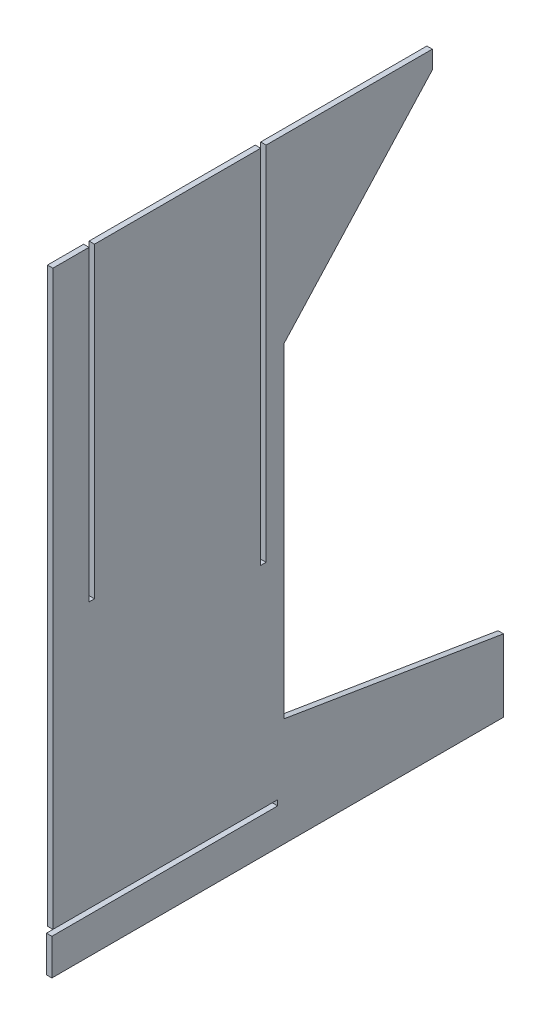
ISO-10303-21;
HEADER;
FILE_DESCRIPTION(('STEP AP214'),'2;1');
FILE_NAME('part.step','',(''),(''),'','','');
FILE_SCHEMA(('AUTOMOTIVE_DESIGN { 1 0 10303 214 1 1 1 1 }'));
ENDSEC;
DATA;
#1=APPLICATION_CONTEXT('core data for automotive mechanical design processes');
#2=APPLICATION_PROTOCOL_DEFINITION('international standard','automotive_design',2000,#1);
#3=PRODUCT_CONTEXT('',#1,'mechanical');
#4=PRODUCT('Part','Part','',(#3));
#5=PRODUCT_RELATED_PRODUCT_CATEGORY('part','',(#4));
#6=PRODUCT_DEFINITION_FORMATION('','',#4);
#7=PRODUCT_DEFINITION_CONTEXT('part definition',#1,'design');
#8=PRODUCT_DEFINITION('design','',#6,#7);
#9=PRODUCT_DEFINITION_SHAPE('','',#8);
#10=(LENGTH_UNIT() NAMED_UNIT(*) SI_UNIT(.MILLI.,.METRE.));
#11=(NAMED_UNIT(*) PLANE_ANGLE_UNIT() SI_UNIT($,.RADIAN.));
#12=(NAMED_UNIT(*) SI_UNIT($,.STERADIAN.) SOLID_ANGLE_UNIT());
#13=UNCERTAINTY_MEASURE_WITH_UNIT(LENGTH_MEASURE(1.E-05),#10,'distance_accuracy_value','');
#14=(GEOMETRIC_REPRESENTATION_CONTEXT(3) GLOBAL_UNCERTAINTY_ASSIGNED_CONTEXT((#13)) GLOBAL_UNIT_ASSIGNED_CONTEXT((#10,
#11,#12)) REPRESENTATION_CONTEXT('',''));
#15=CARTESIAN_POINT('',(0.,0.,0.));
#16=DIRECTION('',(0.,0.,1.));
#17=DIRECTION('',(1.,0.,0.));
#18=AXIS2_PLACEMENT_3D('',#15,#16,#17);
#19=CARTESIAN_POINT('',(3.,50.0959820841257,104.430296427276));
#20=DIRECTION('',(0.,-1.,0.));
#21=DIRECTION('',(0.,0.,-1.));
#22=AXIS2_PLACEMENT_3D('',#19,#20,#21);
#23=PLANE('',#22);
#24=DIRECTION('',(0.,0.,1.));
#25=VECTOR('',#24,1.);
#26=CARTESIAN_POINT('',(0.,50.0959820841257,104.430296427276));
#27=LINE('',#26,#25);
#28=CARTESIAN_POINT('',(0.,50.0959820841257,104.430296427276));
#29=VERTEX_POINT('',#28);
#30=CARTESIAN_POINT('',(0.,50.0959820841257,124.430296427276));
#31=VERTEX_POINT('',#30);
#32=EDGE_CURVE('E212',#29,#31,#27,.T.);
#33=ORIENTED_EDGE('',*,*,#32,.T.);
#34=DIRECTION('',(-1.,0.,0.));
#35=VECTOR('',#34,1.);
#36=CARTESIAN_POINT('',(3.,50.0959820841257,124.430296427276));
#37=LINE('',#36,#35);
#38=CARTESIAN_POINT('',(3.,50.0959820841257,124.430296427276));
#39=VERTEX_POINT('',#38);
#40=EDGE_CURVE('E11',#39,#31,#37,.T.);
#41=ORIENTED_EDGE('',*,*,#40,.F.);
#42=DIRECTION('',(0.,0.,1.));
#43=VECTOR('',#42,1.);
#44=CARTESIAN_POINT('',(3.,50.0959820841257,104.430296427276));
#45=LINE('',#44,#43);
#46=CARTESIAN_POINT('',(3.,50.0959820841257,104.430296427276));
#47=VERTEX_POINT('',#46);
#48=EDGE_CURVE('E270',#47,#39,#45,.T.);
#49=ORIENTED_EDGE('',*,*,#48,.F.);
#50=DIRECTION('',(-1.,0.,0.));
#51=VECTOR('',#50,1.);
#52=CARTESIAN_POINT('',(3.,50.0959820841257,104.430296427276));
#53=LINE('',#52,#51);
#54=EDGE_CURVE('E208',#47,#29,#53,.T.);
#55=ORIENTED_EDGE('',*,*,#54,.T.);
#56=EDGE_LOOP('',(#33,#41,#49,#55));
#57=FACE_BOUND('',#56,.T.);
#58=ADVANCED_FACE('F39',(#57),#23,.F.);
#59=CARTESIAN_POINT('',(3.,-266.903540618244,124.430296427276));
#60=DIRECTION('',(0.,0.,-1.));
#61=DIRECTION('',(-1.,0.,0.));
#62=AXIS2_PLACEMENT_3D('',#59,#60,#61);
#63=PLANE('',#62);
#64=DIRECTION('',(0.,-1.,0.));
#65=VECTOR('',#64,1.);
#66=CARTESIAN_POINT('',(0.,-266.903540618244,124.430296427276));
#67=LINE('',#66,#65);
#68=CARTESIAN_POINT('',(0.,-266.903540618244,124.430296427276));
#69=VERTEX_POINT('',#68);
#70=EDGE_CURVE('E216',#31,#69,#67,.T.);
#71=ORIENTED_EDGE('',*,*,#70,.T.);
#72=DIRECTION('',(-1.,0.,0.));
#73=VECTOR('',#72,1.);
#74=CARTESIAN_POINT('',(3.,-266.903540618244,124.430296427276));
#75=LINE('',#74,#73);
#76=CARTESIAN_POINT('',(3.,-266.903540618244,124.430296427276));
#77=VERTEX_POINT('',#76);
#78=EDGE_CURVE('E48',#77,#69,#75,.T.);
#79=ORIENTED_EDGE('',*,*,#78,.F.);
#80=DIRECTION('',(0.,-1.,0.));
#81=VECTOR('',#80,1.);
#82=CARTESIAN_POINT('',(3.,-266.903540618244,124.430296427276));
#83=LINE('',#82,#81);
#84=EDGE_CURVE('E135',#39,#77,#83,.T.);
#85=ORIENTED_EDGE('',*,*,#84,.F.);
#86=ORIENTED_EDGE('',*,*,#40,.T.);
#87=EDGE_LOOP('',(#71,#79,#85,#86));
#88=FACE_BOUND('',#87,.T.);
#89=ADVANCED_FACE('F420',(#88),#63,.F.);
#90=CARTESIAN_POINT('',(3.,-266.903540618244,0.));
#91=DIRECTION('',(0.,1.,0.));
#92=DIRECTION('',(0.,0.,1.));
#93=AXIS2_PLACEMENT_3D('',#90,#91,#92);
#94=PLANE('',#93);
#95=DIRECTION('',(0.,0.,-1.));
#96=VECTOR('',#95,1.);
#97=CARTESIAN_POINT('',(0.,-266.903540618244,0.));
#98=LINE('',#97,#96);
#99=CARTESIAN_POINT('',(0.,-266.903540618244,0.));
#100=VERTEX_POINT('',#99);
#101=EDGE_CURVE('E219',#69,#100,#98,.T.);
#102=ORIENTED_EDGE('',*,*,#101,.T.);
#103=DIRECTION('',(-1.,0.,0.));
#104=VECTOR('',#103,1.);
#105=CARTESIAN_POINT('',(3.,-266.903540618244,0.));
#106=LINE('',#105,#104);
#107=CARTESIAN_POINT('',(3.,-266.903540618244,0.));
#108=VERTEX_POINT('',#107);
#109=EDGE_CURVE('E329',#108,#100,#106,.T.);
#110=ORIENTED_EDGE('',*,*,#109,.F.);
#111=DIRECTION('',(0.,0.,-1.));
#112=VECTOR('',#111,1.);
#113=CARTESIAN_POINT('',(3.,-266.903540618244,0.));
#114=LINE('',#113,#112);
#115=EDGE_CURVE('E339',#77,#108,#114,.T.);
#116=ORIENTED_EDGE('',*,*,#115,.F.);
#117=ORIENTED_EDGE('',*,*,#78,.T.);
#118=EDGE_LOOP('',(#102,#110,#116,#117));
#119=FACE_BOUND('',#118,.T.);
#120=ADVANCED_FACE('F337',(#119),#94,.F.);
#121=CARTESIAN_POINT('',(3.,-269.903540618244,0.));
#122=DIRECTION('',(0.,0.,-1.));
#123=DIRECTION('',(-1.,0.,0.));
#124=AXIS2_PLACEMENT_3D('',#121,#122,#123);
#125=PLANE('',#124);
#126=DIRECTION('',(0.,-1.,0.));
#127=VECTOR('',#126,1.);
#128=CARTESIAN_POINT('',(0.,-269.903540618244,0.));
#129=LINE('',#128,#127);
#130=CARTESIAN_POINT('',(0.,-269.903540618244,0.));
#131=VERTEX_POINT('',#130);
#132=EDGE_CURVE('E222',#100,#131,#129,.T.);
#133=ORIENTED_EDGE('',*,*,#132,.T.);
#134=DIRECTION('',(-1.,0.,0.));
#135=VECTOR('',#134,1.);
#136=CARTESIAN_POINT('',(3.,-269.903540618244,0.));
#137=LINE('',#136,#135);
#138=CARTESIAN_POINT('',(3.,-269.903540618244,0.));
#139=VERTEX_POINT('',#138);
#140=EDGE_CURVE('E325',#139,#131,#137,.T.);
#141=ORIENTED_EDGE('',*,*,#140,.F.);
#142=DIRECTION('',(0.,-1.,0.));
#143=VECTOR('',#142,1.);
#144=CARTESIAN_POINT('',(3.,-269.903540618244,0.));
#145=LINE('',#144,#143);
#146=EDGE_CURVE('E358',#108,#139,#145,.T.);
#147=ORIENTED_EDGE('',*,*,#146,.F.);
#148=ORIENTED_EDGE('',*,*,#109,.T.);
#149=EDGE_LOOP('',(#133,#141,#147,#148));
#150=FACE_BOUND('',#149,.T.);
#151=ADVANCED_FACE('F348',(#150),#125,.F.);
#152=CARTESIAN_POINT('',(3.,-269.903540618244,125.));
#153=DIRECTION('',(0.,-1.,0.));
#154=DIRECTION('',(0.,0.,-1.));
#155=AXIS2_PLACEMENT_3D('',#152,#153,#154);
#156=PLANE('',#155);
#157=DIRECTION('',(0.,0.,1.));
#158=VECTOR('',#157,1.);
#159=CARTESIAN_POINT('',(0.,-269.903540618244,125.));
#160=LINE('',#159,#158);
#161=CARTESIAN_POINT('',(0.,-269.903540618244,125.));
#162=VERTEX_POINT('',#161);
#163=EDGE_CURVE('E225',#131,#162,#160,.T.);
#164=ORIENTED_EDGE('',*,*,#163,.T.);
#165=DIRECTION('',(-1.,0.,0.));
#166=VECTOR('',#165,1.);
#167=CARTESIAN_POINT('',(3.,-269.903540618244,125.));
#168=LINE('',#167,#166);
#169=CARTESIAN_POINT('',(3.,-269.903540618244,125.));
#170=VERTEX_POINT('',#169);
#171=EDGE_CURVE('E321',#170,#162,#168,.T.);
#172=ORIENTED_EDGE('',*,*,#171,.F.);
#173=DIRECTION('',(0.,0.,1.));
#174=VECTOR('',#173,1.);
#175=CARTESIAN_POINT('',(3.,-269.903540618244,125.));
#176=LINE('',#175,#174);
#177=EDGE_CURVE('E354',#139,#170,#176,.T.);
#178=ORIENTED_EDGE('',*,*,#177,.F.);
#179=ORIENTED_EDGE('',*,*,#140,.T.);
#180=EDGE_LOOP('',(#164,#172,#178,#179));
#181=FACE_BOUND('',#180,.T.);
#182=ADVANCED_FACE('F352',(#181),#156,.F.);
#183=CARTESIAN_POINT('',(3.,-289.903540618244,125.));
#184=DIRECTION('',(0.,0.,-1.));
#185=DIRECTION('',(-1.,0.,0.));
#186=AXIS2_PLACEMENT_3D('',#183,#184,#185);
#187=PLANE('',#186);
#188=DIRECTION('',(0.,-1.,0.));
#189=VECTOR('',#188,1.);
#190=CARTESIAN_POINT('',(0.,-289.903540618244,125.));
#191=LINE('',#190,#189);
#192=CARTESIAN_POINT('',(0.,-289.903540618244,125.));
#193=VERTEX_POINT('',#192);
#194=EDGE_CURVE('E228',#162,#193,#191,.T.);
#195=ORIENTED_EDGE('',*,*,#194,.T.);
#196=DIRECTION('',(-1.,0.,0.));
#197=VECTOR('',#196,1.);
#198=CARTESIAN_POINT('',(3.,-289.903540618244,125.));
#199=LINE('',#198,#197);
#200=CARTESIAN_POINT('',(3.,-289.903540618244,125.));
#201=VERTEX_POINT('',#200);
#202=EDGE_CURVE('E317',#201,#193,#199,.T.);
#203=ORIENTED_EDGE('',*,*,#202,.F.);
#204=DIRECTION('',(0.,-1.,0.));
#205=VECTOR('',#204,1.);
#206=CARTESIAN_POINT('',(3.,-289.903540618244,125.));
#207=LINE('',#206,#205);
#208=EDGE_CURVE('E357',#170,#201,#207,.T.);
#209=ORIENTED_EDGE('',*,*,#208,.F.);
#210=ORIENTED_EDGE('',*,*,#171,.T.);
#211=EDGE_LOOP('',(#195,#203,#209,#210));
#212=FACE_BOUND('',#211,.T.);
#213=ADVANCED_FACE('F433',(#212),#187,.F.);
#214=CARTESIAN_POINT('',(3.,-289.903540618244,-125.));
#215=DIRECTION('',(0.,1.,0.));
#216=DIRECTION('',(0.,0.,1.));
#217=AXIS2_PLACEMENT_3D('',#214,#215,#216);
#218=PLANE('',#217);
#219=DIRECTION('',(0.,0.,-1.));
#220=VECTOR('',#219,1.);
#221=CARTESIAN_POINT('',(0.,-289.903540618244,-125.));
#222=LINE('',#221,#220);
#223=CARTESIAN_POINT('',(0.,-289.903540618244,-125.));
#224=VERTEX_POINT('',#223);
#225=EDGE_CURVE('E231',#193,#224,#222,.T.);
#226=ORIENTED_EDGE('',*,*,#225,.T.);
#227=DIRECTION('',(-1.,0.,0.));
#228=VECTOR('',#227,1.);
#229=CARTESIAN_POINT('',(3.,-289.903540618244,-125.));
#230=LINE('',#229,#228);
#231=CARTESIAN_POINT('',(3.,-289.903540618244,-125.));
#232=VERTEX_POINT('',#231);
#233=EDGE_CURVE('E313',#232,#224,#230,.T.);
#234=ORIENTED_EDGE('',*,*,#233,.F.);
#235=DIRECTION('',(0.,0.,-1.));
#236=VECTOR('',#235,1.);
#237=CARTESIAN_POINT('',(3.,-289.903540618244,-125.));
#238=LINE('',#237,#236);
#239=EDGE_CURVE('E362',#201,#232,#238,.T.);
#240=ORIENTED_EDGE('',*,*,#239,.F.);
#241=ORIENTED_EDGE('',*,*,#202,.T.);
#242=EDGE_LOOP('',(#226,#234,#240,#241));
#243=FACE_BOUND('',#242,.T.);
#244=ADVANCED_FACE('F436',(#243),#218,.F.);
#245=CARTESIAN_POINT('',(3.,-249.903540618244,-125.));
#246=DIRECTION('',(0.,0.,1.));
#247=DIRECTION('',(1.,0.,0.));
#248=AXIS2_PLACEMENT_3D('',#245,#246,#247);
#249=PLANE('',#248);
#250=DIRECTION('',(0.,1.,0.));
#251=VECTOR('',#250,1.);
#252=CARTESIAN_POINT('',(0.,-249.903540618244,-125.));
#253=LINE('',#252,#251);
#254=CARTESIAN_POINT('',(0.,-249.903540618244,-125.));
#255=VERTEX_POINT('',#254);
#256=EDGE_CURVE('E234',#224,#255,#253,.T.);
#257=ORIENTED_EDGE('',*,*,#256,.T.);
#258=DIRECTION('',(-1.,0.,0.));
#259=VECTOR('',#258,1.);
#260=CARTESIAN_POINT('',(3.,-249.903540618244,-125.));
#261=LINE('',#260,#259);
#262=CARTESIAN_POINT('',(3.,-249.903540618244,-125.));
#263=VERTEX_POINT('',#262);
#264=EDGE_CURVE('E309',#263,#255,#261,.T.);
#265=ORIENTED_EDGE('',*,*,#264,.F.);
#266=DIRECTION('',(0.,1.,0.));
#267=VECTOR('',#266,1.);
#268=CARTESIAN_POINT('',(3.,-249.903540618244,-125.));
#269=LINE('',#268,#267);
#270=EDGE_CURVE('E369',#232,#263,#269,.T.);
#271=ORIENTED_EDGE('',*,*,#270,.F.);
#272=ORIENTED_EDGE('',*,*,#233,.T.);
#273=EDGE_LOOP('',(#257,#265,#271,#272));
#274=FACE_BOUND('',#273,.T.);
#275=ADVANCED_FACE('F440',(#274),#249,.F.);
#276=CARTESIAN_POINT('',(3.,-229.903540618244,-3.56970357272368));
#277=DIRECTION('',(0.,-0.986706235781448,0.162514012534323));
#278=DIRECTION('',(0.,-0.162514012534323,-0.986706235781448));
#279=AXIS2_PLACEMENT_3D('',#276,#277,#278);
#280=PLANE('',#279);
#281=DIRECTION('',(0.,0.162514012534323,0.986706235781448));
#282=VECTOR('',#281,1.);
#283=CARTESIAN_POINT('',(0.,-229.903540618244,-3.56970357272368));
#284=LINE('',#283,#282);
#285=CARTESIAN_POINT('',(0.,-229.903540618244,-3.56970357272368));
#286=VERTEX_POINT('',#285);
#287=EDGE_CURVE('E237',#255,#286,#284,.T.);
#288=ORIENTED_EDGE('',*,*,#287,.T.);
#289=DIRECTION('',(-1.,0.,0.));
#290=VECTOR('',#289,1.);
#291=CARTESIAN_POINT('',(3.,-229.903540618244,-3.56970357272368));
#292=LINE('',#291,#290);
#293=CARTESIAN_POINT('',(3.,-229.903540618244,-3.56970357272368));
#294=VERTEX_POINT('',#293);
#295=EDGE_CURVE('E305',#294,#286,#292,.T.);
#296=ORIENTED_EDGE('',*,*,#295,.F.);
#297=DIRECTION('',(0.,0.162514012534323,0.986706235781448));
#298=VECTOR('',#297,1.);
#299=CARTESIAN_POINT('',(3.,-229.903540618244,-3.56970357272368));
#300=LINE('',#299,#298);
#301=EDGE_CURVE('E372',#263,#294,#300,.T.);
#302=ORIENTED_EDGE('',*,*,#301,.F.);
#303=ORIENTED_EDGE('',*,*,#264,.T.);
#304=EDGE_LOOP('',(#288,#296,#302,#303));
#305=FACE_BOUND('',#304,.T.);
#306=ADVANCED_FACE('F444',(#305),#280,.F.);
#307=CARTESIAN_POINT('',(3.,-49.9035406182441,-3.56970357272366));
#308=DIRECTION('',(0.,0.,1.));
#309=DIRECTION('',(0.,-1.,0.));
#310=AXIS2_PLACEMENT_3D('',#307,#308,#309);
#311=PLANE('',#310);
#312=DIRECTION('',(0.,1.,0.));
#313=VECTOR('',#312,1.);
#314=CARTESIAN_POINT('',(0.,-49.9035406182441,-3.56970357272366));
#315=LINE('',#314,#313);
#316=CARTESIAN_POINT('',(0.,-49.9035406182441,-3.56970357272366));
#317=VERTEX_POINT('',#316);
#318=EDGE_CURVE('E240',#286,#317,#315,.T.);
#319=ORIENTED_EDGE('',*,*,#318,.T.);
#320=DIRECTION('',(-1.,0.,0.));
#321=VECTOR('',#320,1.);
#322=CARTESIAN_POINT('',(3.,-49.9035406182441,-3.56970357272366));
#323=LINE('',#322,#321);
#324=CARTESIAN_POINT('',(3.,-49.9035406182441,-3.56970357272366));
#325=VERTEX_POINT('',#324);
#326=EDGE_CURVE('E301',#325,#317,#323,.T.);
#327=ORIENTED_EDGE('',*,*,#326,.F.);
#328=DIRECTION('',(0.,1.,0.));
#329=VECTOR('',#328,1.);
#330=CARTESIAN_POINT('',(3.,-49.9035406182441,-3.56970357272366));
#331=LINE('',#330,#329);
#332=EDGE_CURVE('E375',#294,#325,#331,.T.);
#333=ORIENTED_EDGE('',*,*,#332,.F.);
#334=ORIENTED_EDGE('',*,*,#295,.T.);
#335=EDGE_LOOP('',(#319,#327,#333,#334));
#336=FACE_BOUND('',#335,.T.);
#337=ADVANCED_FACE('F448',(#336),#311,.F.);
#338=CARTESIAN_POINT('',(3.,40.0959820841257,-85.5697035727237));
#339=DIRECTION('',(0.,0.673491947817214,0.739194559115105));
#340=DIRECTION('',(0.,-0.739194559115105,0.673491947817214));
#341=AXIS2_PLACEMENT_3D('',#338,#339,#340);
#342=PLANE('',#341);
#343=DIRECTION('',(0.,0.739194559115105,-0.673491947817214));
#344=VECTOR('',#343,1.);
#345=CARTESIAN_POINT('',(0.,40.0959820841257,-85.5697035727237));
#346=LINE('',#345,#344);
#347=CARTESIAN_POINT('',(0.,40.0959820841257,-85.5697035727237));
#348=VERTEX_POINT('',#347);
#349=EDGE_CURVE('E243',#317,#348,#346,.T.);
#350=ORIENTED_EDGE('',*,*,#349,.T.);
#351=DIRECTION('',(-1.,0.,0.));
#352=VECTOR('',#351,1.);
#353=CARTESIAN_POINT('',(3.,40.0959820841257,-85.5697035727237));
#354=LINE('',#353,#352);
#355=CARTESIAN_POINT('',(3.,40.0959820841257,-85.5697035727237));
#356=VERTEX_POINT('',#355);
#357=EDGE_CURVE('E297',#356,#348,#354,.T.);
#358=ORIENTED_EDGE('',*,*,#357,.F.);
#359=DIRECTION('',(0.,0.739194559115105,-0.673491947817214));
#360=VECTOR('',#359,1.);
#361=CARTESIAN_POINT('',(3.,40.0959820841257,-85.5697035727237));
#362=LINE('',#361,#360);
#363=EDGE_CURVE('E378',#325,#356,#362,.T.);
#364=ORIENTED_EDGE('',*,*,#363,.F.);
#365=ORIENTED_EDGE('',*,*,#326,.T.);
#366=EDGE_LOOP('',(#350,#358,#364,#365));
#367=FACE_BOUND('',#366,.T.);
#368=ADVANCED_FACE('F452',(#367),#342,.F.);
#369=CARTESIAN_POINT('',(3.,50.0959820841257,-85.5697035727237));
#370=DIRECTION('',(0.,0.,1.));
#371=DIRECTION('',(1.,0.,0.));
#372=AXIS2_PLACEMENT_3D('',#369,#370,#371);
#373=PLANE('',#372);
#374=DIRECTION('',(0.,1.,0.));
#375=VECTOR('',#374,1.);
#376=CARTESIAN_POINT('',(0.,50.0959820841257,-85.5697035727237));
#377=LINE('',#376,#375);
#378=CARTESIAN_POINT('',(0.,50.0959820841257,-85.5697035727237));
#379=VERTEX_POINT('',#378);
#380=EDGE_CURVE('E246',#348,#379,#377,.T.);
#381=ORIENTED_EDGE('',*,*,#380,.T.);
#382=DIRECTION('',(-1.,0.,0.));
#383=VECTOR('',#382,1.);
#384=CARTESIAN_POINT('',(3.,50.0959820841257,-85.5697035727237));
#385=LINE('',#384,#383);
#386=CARTESIAN_POINT('',(3.,50.0959820841257,-85.5697035727237));
#387=VERTEX_POINT('',#386);
#388=EDGE_CURVE('E293',#387,#379,#385,.T.);
#389=ORIENTED_EDGE('',*,*,#388,.F.);
#390=DIRECTION('',(0.,1.,0.));
#391=VECTOR('',#390,1.);
#392=CARTESIAN_POINT('',(3.,50.0959820841257,-85.5697035727237));
#393=LINE('',#392,#391);
#394=EDGE_CURVE('E381',#356,#387,#393,.T.);
#395=ORIENTED_EDGE('',*,*,#394,.F.);
#396=ORIENTED_EDGE('',*,*,#357,.T.);
#397=EDGE_LOOP('',(#381,#389,#395,#396));
#398=FACE_BOUND('',#397,.T.);
#399=ADVANCED_FACE('F456',(#398),#373,.F.);
#400=CARTESIAN_POINT('',(3.,50.0959820841257,-85.5697035727237));
#401=DIRECTION('',(0.,-1.,0.));
#402=DIRECTION('',(0.,0.,-1.));
#403=AXIS2_PLACEMENT_3D('',#400,#401,#402);
#404=PLANE('',#403);
#405=DIRECTION('',(0.,0.,1.));
#406=VECTOR('',#405,1.);
#407=CARTESIAN_POINT('',(0.,50.0959820841257,-85.5697035727237));
#408=LINE('',#407,#406);
#409=CARTESIAN_POINT('',(0.,50.0959820841257,6.43029642727634));
#410=VERTEX_POINT('',#409);
#411=EDGE_CURVE('E249',#379,#410,#408,.T.);
#412=ORIENTED_EDGE('',*,*,#411,.T.);
#413=DIRECTION('',(-1.,0.,0.));
#414=VECTOR('',#413,1.);
#415=CARTESIAN_POINT('',(3.,50.0959820841257,6.43029642727634));
#416=LINE('',#415,#414);
#417=CARTESIAN_POINT('',(3.,50.0959820841257,6.43029642727634));
#418=VERTEX_POINT('',#417);
#419=EDGE_CURVE('E289',#418,#410,#416,.T.);
#420=ORIENTED_EDGE('',*,*,#419,.F.);
#421=DIRECTION('',(0.,0.,1.));
#422=VECTOR('',#421,1.);
#423=CARTESIAN_POINT('',(3.,50.0959820841257,-85.5697035727237));
#424=LINE('',#423,#422);
#425=EDGE_CURVE('E384',#387,#418,#424,.T.);
#426=ORIENTED_EDGE('',*,*,#425,.F.);
#427=ORIENTED_EDGE('',*,*,#388,.T.);
#428=EDGE_LOOP('',(#412,#420,#426,#427));
#429=FACE_BOUND('',#428,.T.);
#430=ADVANCED_FACE('F460',(#429),#404,.F.);
#431=CARTESIAN_POINT('',(3.,50.0959820841257,6.43029642727634));
#432=DIRECTION('',(0.,0.,-1.));
#433=DIRECTION('',(-1.,0.,0.));
#434=AXIS2_PLACEMENT_3D('',#431,#432,#433);
#435=PLANE('',#434);
#436=DIRECTION('',(0.,-1.,0.));
#437=VECTOR('',#436,1.);
#438=CARTESIAN_POINT('',(0.,50.0959820841257,6.43029642727634));
#439=LINE('',#438,#437);
#440=CARTESIAN_POINT('',(0.,-149.903540618244,6.43029642727634));
#441=VERTEX_POINT('',#440);
#442=EDGE_CURVE('E252',#410,#441,#439,.T.);
#443=ORIENTED_EDGE('',*,*,#442,.T.);
#444=DIRECTION('',(-1.,0.,0.));
#445=VECTOR('',#444,1.);
#446=CARTESIAN_POINT('',(3.,-149.903540618244,6.43029642727634));
#447=LINE('',#446,#445);
#448=CARTESIAN_POINT('',(3.,-149.903540618244,6.43029642727634));
#449=VERTEX_POINT('',#448);
#450=EDGE_CURVE('E285',#449,#441,#447,.T.);
#451=ORIENTED_EDGE('',*,*,#450,.F.);
#452=DIRECTION('',(0.,-1.,0.));
#453=VECTOR('',#452,1.);
#454=CARTESIAN_POINT('',(3.,50.0959820841257,6.43029642727634));
#455=LINE('',#454,#453);
#456=EDGE_CURVE('E387',#418,#449,#455,.T.);
#457=ORIENTED_EDGE('',*,*,#456,.F.);
#458=ORIENTED_EDGE('',*,*,#419,.T.);
#459=EDGE_LOOP('',(#443,#451,#457,#458));
#460=FACE_BOUND('',#459,.T.);
#461=ADVANCED_FACE('F464',(#460),#435,.F.);
#462=CARTESIAN_POINT('',(3.,-149.903540618244,6.43029642727634));
#463=DIRECTION('',(0.,-1.,0.));
#464=DIRECTION('',(0.,0.,-1.));
#465=AXIS2_PLACEMENT_3D('',#462,#463,#464);
#466=PLANE('',#465);
#467=DIRECTION('',(0.,0.,1.));
#468=VECTOR('',#467,1.);
#469=CARTESIAN_POINT('',(0.,-149.903540618244,6.43029642727634));
#470=LINE('',#469,#468);
#471=CARTESIAN_POINT('',(0.,-149.903540618244,9.43029642727634));
#472=VERTEX_POINT('',#471);
#473=EDGE_CURVE('E255',#441,#472,#470,.T.);
#474=ORIENTED_EDGE('',*,*,#473,.T.);
#475=DIRECTION('',(-1.,0.,0.));
#476=VECTOR('',#475,1.);
#477=CARTESIAN_POINT('',(3.,-149.903540618244,9.43029642727634));
#478=LINE('',#477,#476);
#479=CARTESIAN_POINT('',(3.,-149.903540618244,9.43029642727634));
#480=VERTEX_POINT('',#479);
#481=EDGE_CURVE('E281',#480,#472,#478,.T.);
#482=ORIENTED_EDGE('',*,*,#481,.F.);
#483=DIRECTION('',(0.,0.,1.));
#484=VECTOR('',#483,1.);
#485=CARTESIAN_POINT('',(3.,-149.903540618244,6.43029642727634));
#486=LINE('',#485,#484);
#487=EDGE_CURVE('E390',#449,#480,#486,.T.);
#488=ORIENTED_EDGE('',*,*,#487,.F.);
#489=ORIENTED_EDGE('',*,*,#450,.T.);
#490=EDGE_LOOP('',(#474,#482,#488,#489));
#491=FACE_BOUND('',#490,.T.);
#492=ADVANCED_FACE('F468',(#491),#466,.F.);
#493=CARTESIAN_POINT('',(3.,-149.903540618244,9.43029642727634));
#494=DIRECTION('',(0.,0.,1.));
#495=DIRECTION('',(1.,0.,0.));
#496=AXIS2_PLACEMENT_3D('',#493,#494,#495);
#497=PLANE('',#496);
#498=DIRECTION('',(0.,1.,0.));
#499=VECTOR('',#498,1.);
#500=CARTESIAN_POINT('',(0.,-149.903540618244,9.43029642727634));
#501=LINE('',#500,#499);
#502=CARTESIAN_POINT('',(0.,50.0959820841257,9.43029642727634));
#503=VERTEX_POINT('',#502);
#504=EDGE_CURVE('E258',#472,#503,#501,.T.);
#505=ORIENTED_EDGE('',*,*,#504,.T.);
#506=DIRECTION('',(-1.,0.,0.));
#507=VECTOR('',#506,1.);
#508=CARTESIAN_POINT('',(3.,50.0959820841257,9.43029642727634));
#509=LINE('',#508,#507);
#510=CARTESIAN_POINT('',(3.,50.0959820841257,9.43029642727634));
#511=VERTEX_POINT('',#510);
#512=EDGE_CURVE('E277',#511,#503,#509,.T.);
#513=ORIENTED_EDGE('',*,*,#512,.F.);
#514=DIRECTION('',(0.,1.,0.));
#515=VECTOR('',#514,1.);
#516=CARTESIAN_POINT('',(3.,-149.903540618244,9.43029642727634));
#517=LINE('',#516,#515);
#518=EDGE_CURVE('E393',#480,#511,#517,.T.);
#519=ORIENTED_EDGE('',*,*,#518,.F.);
#520=ORIENTED_EDGE('',*,*,#481,.T.);
#521=EDGE_LOOP('',(#505,#513,#519,#520));
#522=FACE_BOUND('',#521,.T.);
#523=ADVANCED_FACE('F401',(#522),#497,.F.);
#524=CARTESIAN_POINT('',(3.,50.0959820841257,9.43029642727634));
#525=DIRECTION('',(0.,-1.,0.));
#526=DIRECTION('',(0.,0.,-1.));
#527=AXIS2_PLACEMENT_3D('',#524,#525,#526);
#528=PLANE('',#527);
#529=DIRECTION('',(0.,0.,1.));
#530=VECTOR('',#529,1.);
#531=CARTESIAN_POINT('',(0.,50.0959820841257,9.43029642727634));
#532=LINE('',#531,#530);
#533=CARTESIAN_POINT('',(0.,50.0959820841257,101.430296427276));
#534=VERTEX_POINT('',#533);
#535=EDGE_CURVE('E261',#503,#534,#532,.T.);
#536=ORIENTED_EDGE('',*,*,#535,.T.);
#537=DIRECTION('',(-1.,0.,0.));
#538=VECTOR('',#537,1.);
#539=CARTESIAN_POINT('',(3.,50.0959820841257,101.430296427276));
#540=LINE('',#539,#538);
#541=CARTESIAN_POINT('',(3.,50.0959820841257,101.430296427276));
#542=VERTEX_POINT('',#541);
#543=EDGE_CURVE('E201',#542,#534,#540,.T.);
#544=ORIENTED_EDGE('',*,*,#543,.F.);
#545=DIRECTION('',(0.,0.,1.));
#546=VECTOR('',#545,1.);
#547=CARTESIAN_POINT('',(3.,50.0959820841257,9.43029642727634));
#548=LINE('',#547,#546);
#549=EDGE_CURVE('E190',#511,#542,#548,.T.);
#550=ORIENTED_EDGE('',*,*,#549,.F.);
#551=ORIENTED_EDGE('',*,*,#512,.T.);
#552=EDGE_LOOP('',(#536,#544,#550,#551));
#553=FACE_BOUND('',#552,.T.);
#554=ADVANCED_FACE('F405',(#553),#528,.F.);
#555=CARTESIAN_POINT('',(3.,50.0959820841257,101.430296427276));
#556=DIRECTION('',(0.,0.,-1.));
#557=DIRECTION('',(-1.,0.,0.));
#558=AXIS2_PLACEMENT_3D('',#555,#556,#557);
#559=PLANE('',#558);
#560=DIRECTION('',(0.,-1.,0.));
#561=VECTOR('',#560,1.);
#562=CARTESIAN_POINT('',(0.,50.0959820841257,101.430296427276));
#563=LINE('',#562,#561);
#564=CARTESIAN_POINT('',(0.,-119.904017915874,101.430296427276));
#565=VERTEX_POINT('',#564);
#566=EDGE_CURVE('E199',#534,#565,#563,.T.);
#567=ORIENTED_EDGE('',*,*,#566,.T.);
#568=DIRECTION('',(-1.,0.,0.));
#569=VECTOR('',#568,1.);
#570=CARTESIAN_POINT('',(3.,-119.904017915874,101.430296427276));
#571=LINE('',#570,#569);
#572=CARTESIAN_POINT('',(3.,-119.904017915874,101.430296427276));
#573=VERTEX_POINT('',#572);
#574=EDGE_CURVE('E196',#573,#565,#571,.T.);
#575=ORIENTED_EDGE('',*,*,#574,.F.);
#576=DIRECTION('',(0.,-1.,0.));
#577=VECTOR('',#576,1.);
#578=CARTESIAN_POINT('',(3.,50.0959820841257,101.430296427276));
#579=LINE('',#578,#577);
#580=EDGE_CURVE('E184',#542,#573,#579,.T.);
#581=ORIENTED_EDGE('',*,*,#580,.F.);
#582=ORIENTED_EDGE('',*,*,#543,.T.);
#583=EDGE_LOOP('',(#567,#575,#581,#582));
#584=FACE_BOUND('',#583,.T.);
#585=ADVANCED_FACE('F197',(#584),#559,.F.);
#586=CARTESIAN_POINT('',(3.,-119.904017915874,101.430296427276));
#587=DIRECTION('',(0.,-1.,0.));
#588=DIRECTION('',(0.,0.,-1.));
#589=AXIS2_PLACEMENT_3D('',#586,#587,#588);
#590=PLANE('',#589);
#591=DIRECTION('',(0.,0.,1.));
#592=VECTOR('',#591,1.);
#593=CARTESIAN_POINT('',(0.,-119.904017915874,101.430296427276));
#594=LINE('',#593,#592);
#595=CARTESIAN_POINT('',(0.,-119.904017915874,104.430296427276));
#596=VERTEX_POINT('',#595);
#597=EDGE_CURVE('E121',#565,#596,#594,.T.);
#598=ORIENTED_EDGE('',*,*,#597,.T.);
#599=DIRECTION('',(-1.,0.,0.));
#600=VECTOR('',#599,1.);
#601=CARTESIAN_POINT('',(3.,-119.904017915874,104.430296427276));
#602=LINE('',#601,#600);
#603=CARTESIAN_POINT('',(3.,-119.904017915874,104.430296427276));
#604=VERTEX_POINT('',#603);
#605=EDGE_CURVE('E202',#604,#596,#602,.T.);
#606=ORIENTED_EDGE('',*,*,#605,.F.);
#607=DIRECTION('',(0.,0.,1.));
#608=VECTOR('',#607,1.);
#609=CARTESIAN_POINT('',(3.,-119.904017915874,101.430296427276));
#610=LINE('',#609,#608);
#611=EDGE_CURVE('E188',#573,#604,#610,.T.);
#612=ORIENTED_EDGE('',*,*,#611,.F.);
#613=ORIENTED_EDGE('',*,*,#574,.T.);
#614=EDGE_LOOP('',(#598,#606,#612,#613));
#615=FACE_BOUND('',#614,.T.);
#616=ADVANCED_FACE('F204',(#615),#590,.F.);
#617=CARTESIAN_POINT('',(3.,-119.904017915874,104.430296427276));
#618=DIRECTION('',(0.,0.,1.));
#619=DIRECTION('',(1.,0.,0.));
#620=AXIS2_PLACEMENT_3D('',#617,#618,#619);
#621=PLANE('',#620);
#622=DIRECTION('',(0.,1.,0.));
#623=VECTOR('',#622,1.);
#624=CARTESIAN_POINT('',(0.,-119.904017915874,104.430296427276));
#625=LINE('',#624,#623);
#626=EDGE_CURVE('E127',#596,#29,#625,.T.);
#627=ORIENTED_EDGE('',*,*,#626,.T.);
#628=ORIENTED_EDGE('',*,*,#54,.F.);
#629=DIRECTION('',(0.,1.,0.));
#630=VECTOR('',#629,1.);
#631=CARTESIAN_POINT('',(3.,-119.904017915874,104.430296427276));
#632=LINE('',#631,#630);
#633=EDGE_CURVE('E56',#604,#47,#632,.T.);
#634=ORIENTED_EDGE('',*,*,#633,.F.);
#635=ORIENTED_EDGE('',*,*,#605,.T.);
#636=EDGE_LOOP('',(#627,#628,#634,#635));
#637=FACE_BOUND('',#636,.T.);
#638=ADVANCED_FACE('F409',(#637),#621,.F.);
#639=CARTESIAN_POINT('',(3.,0.,0.));
#640=DIRECTION('',(-1.,0.,0.));
#641=DIRECTION('',(0.,0.,1.));
#642=AXIS2_PLACEMENT_3D('',#639,#640,#641);
#643=PLANE('',#642);
#644=ORIENTED_EDGE('',*,*,#48,.T.);
#645=ORIENTED_EDGE('',*,*,#84,.T.);
#646=ORIENTED_EDGE('',*,*,#115,.T.);
#647=ORIENTED_EDGE('',*,*,#146,.T.);
#648=ORIENTED_EDGE('',*,*,#177,.T.);
#649=ORIENTED_EDGE('',*,*,#208,.T.);
#650=ORIENTED_EDGE('',*,*,#239,.T.);
#651=ORIENTED_EDGE('',*,*,#270,.T.);
#652=ORIENTED_EDGE('',*,*,#301,.T.);
#653=ORIENTED_EDGE('',*,*,#332,.T.);
#654=ORIENTED_EDGE('',*,*,#363,.T.);
#655=ORIENTED_EDGE('',*,*,#394,.T.);
#656=ORIENTED_EDGE('',*,*,#425,.T.);
#657=ORIENTED_EDGE('',*,*,#456,.T.);
#658=ORIENTED_EDGE('',*,*,#487,.T.);
#659=ORIENTED_EDGE('',*,*,#518,.T.);
#660=ORIENTED_EDGE('',*,*,#549,.T.);
#661=ORIENTED_EDGE('',*,*,#580,.T.);
#662=ORIENTED_EDGE('',*,*,#611,.T.);
#663=ORIENTED_EDGE('',*,*,#633,.T.);
#664=EDGE_LOOP('',(#644,#645,#646,#647,#648,#649,#650,#651,#652,#653,#654,#655,#656,#657,#658,
#659,#660,#661,#662,#663));
#665=FACE_BOUND('',#664,.T.);
#666=ADVANCED_FACE('F186',(#665),#643,.F.);
#667=CARTESIAN_POINT('',(0.,0.,0.));
#668=DIRECTION('',(-1.,0.,0.));
#669=DIRECTION('',(0.,0.,1.));
#670=AXIS2_PLACEMENT_3D('',#667,#668,#669);
#671=PLANE('',#670);
#672=ORIENTED_EDGE('',*,*,#32,.F.);
#673=ORIENTED_EDGE('',*,*,#626,.F.);
#674=ORIENTED_EDGE('',*,*,#597,.F.);
#675=ORIENTED_EDGE('',*,*,#566,.F.);
#676=ORIENTED_EDGE('',*,*,#535,.F.);
#677=ORIENTED_EDGE('',*,*,#504,.F.);
#678=ORIENTED_EDGE('',*,*,#473,.F.);
#679=ORIENTED_EDGE('',*,*,#442,.F.);
#680=ORIENTED_EDGE('',*,*,#411,.F.);
#681=ORIENTED_EDGE('',*,*,#380,.F.);
#682=ORIENTED_EDGE('',*,*,#349,.F.);
#683=ORIENTED_EDGE('',*,*,#318,.F.);
#684=ORIENTED_EDGE('',*,*,#287,.F.);
#685=ORIENTED_EDGE('',*,*,#256,.F.);
#686=ORIENTED_EDGE('',*,*,#225,.F.);
#687=ORIENTED_EDGE('',*,*,#194,.F.);
#688=ORIENTED_EDGE('',*,*,#163,.F.);
#689=ORIENTED_EDGE('',*,*,#132,.F.);
#690=ORIENTED_EDGE('',*,*,#101,.F.);
#691=ORIENTED_EDGE('',*,*,#70,.F.);
#692=EDGE_LOOP('',(#672,#673,#674,#675,#676,#677,#678,#679,#680,#681,#682,#683,#684,#685,#686,
#687,#688,#689,#690,#691));
#693=FACE_BOUND('',#692,.T.);
#694=ADVANCED_FACE('F343',(#693),#671,.T.);
#695=CLOSED_SHELL('',(#58,#89,#120,#151,#182,#213,#244,#275,#306,#337,#368,#399,#430,#461,#492,
#523,#554,#585,#616,#638,#666,#694));
#696=MANIFOLD_SOLID_BREP('B2',#695);
#697=ADVANCED_BREP_SHAPE_REPRESENTATION('',(#18,#696),#14);
#698=SHAPE_DEFINITION_REPRESENTATION(#9,#697);
ENDSEC;
END-ISO-10303-21;
